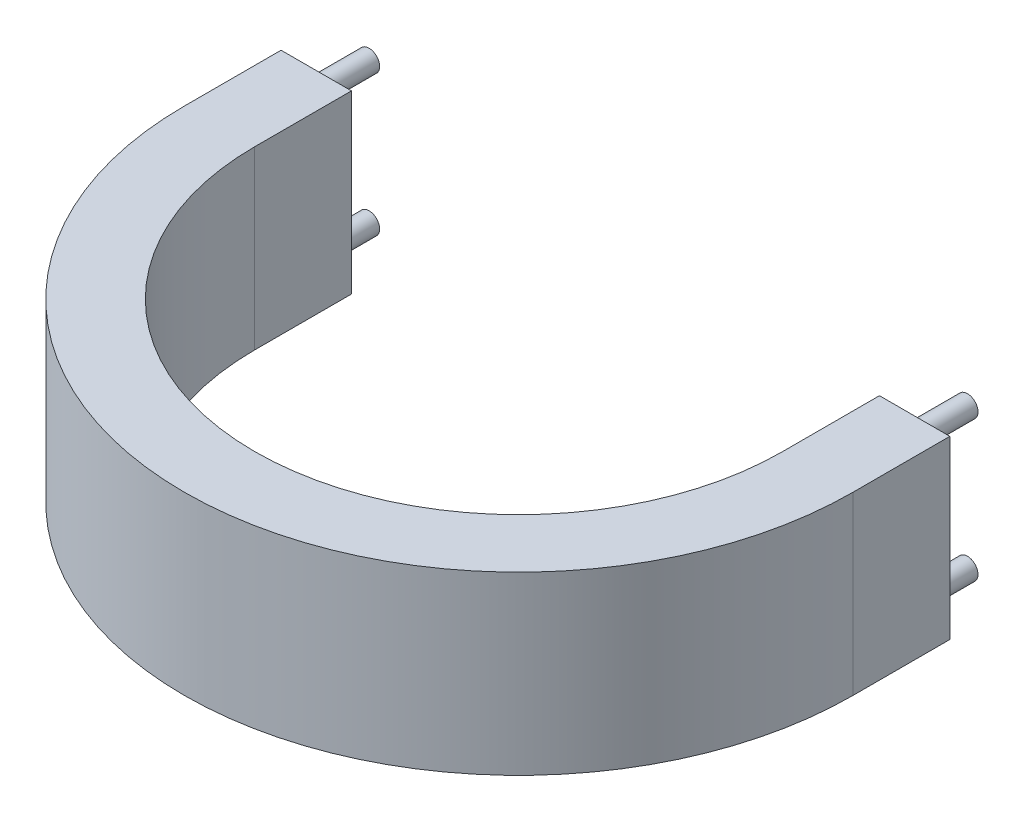
ISO-10303-21;
HEADER;
FILE_DESCRIPTION(('STEP AP214'),'2;1');
FILE_NAME('part.step','',(''),(''),'','','');
FILE_SCHEMA(('AUTOMOTIVE_DESIGN { 1 0 10303 214 1 1 1 1 }'));
ENDSEC;
DATA;
#1=APPLICATION_CONTEXT('core data for automotive mechanical design processes');
#2=APPLICATION_PROTOCOL_DEFINITION('international standard','automotive_design',2000,#1);
#3=PRODUCT_CONTEXT('',#1,'mechanical');
#4=PRODUCT('Part','Part','',(#3));
#5=PRODUCT_RELATED_PRODUCT_CATEGORY('part','',(#4));
#6=PRODUCT_DEFINITION_FORMATION('','',#4);
#7=PRODUCT_DEFINITION_CONTEXT('part definition',#1,'design');
#8=PRODUCT_DEFINITION('design','',#6,#7);
#9=PRODUCT_DEFINITION_SHAPE('','',#8);
#10=(LENGTH_UNIT() NAMED_UNIT(*) SI_UNIT(.MILLI.,.METRE.));
#11=(NAMED_UNIT(*) PLANE_ANGLE_UNIT() SI_UNIT($,.RADIAN.));
#12=(NAMED_UNIT(*) SI_UNIT($,.STERADIAN.) SOLID_ANGLE_UNIT());
#13=UNCERTAINTY_MEASURE_WITH_UNIT(LENGTH_MEASURE(1.E-05),#10,'distance_accuracy_value','');
#14=(GEOMETRIC_REPRESENTATION_CONTEXT(3) GLOBAL_UNCERTAINTY_ASSIGNED_CONTEXT((#13)) GLOBAL_UNIT_ASSIGNED_CONTEXT((#10,
#11,#12)) REPRESENTATION_CONTEXT('',''));
#15=CARTESIAN_POINT('',(0.,0.,0.));
#16=DIRECTION('',(0.,0.,1.));
#17=DIRECTION('',(1.,0.,0.));
#18=AXIS2_PLACEMENT_3D('',#15,#16,#17);
#19=CARTESIAN_POINT('',(0.,20.,0.));
#20=DIRECTION('',(0.,-1.,0.));
#21=DIRECTION('',(0.,0.,-1.));
#22=AXIS2_PLACEMENT_3D('',#19,#20,#21);
#23=CYLINDRICAL_SURFACE('',#22,38.);
#24=CARTESIAN_POINT('',(0.,0.,0.));
#25=DIRECTION('',(0.,1.,0.));
#26=DIRECTION('',(0.,0.,1.));
#27=AXIS2_PLACEMENT_3D('',#24,#25,#26);
#28=CIRCLE('',#27,38.);
#29=CARTESIAN_POINT('',(-38.,0.,0.));
#30=VERTEX_POINT('',#29);
#31=CARTESIAN_POINT('',(38.,0.,0.));
#32=VERTEX_POINT('',#31);
#33=EDGE_CURVE('E135',#30,#32,#28,.T.);
#34=ORIENTED_EDGE('',*,*,#33,.T.);
#35=DIRECTION('',(0.,-1.,0.));
#36=VECTOR('',#35,1.);
#37=CARTESIAN_POINT('',(38.,20.,0.));
#38=LINE('',#37,#36);
#39=CARTESIAN_POINT('',(38.,20.,0.));
#40=VERTEX_POINT('',#39);
#41=EDGE_CURVE('E163',#40,#32,#38,.T.);
#42=ORIENTED_EDGE('',*,*,#41,.F.);
#43=CARTESIAN_POINT('',(0.,20.,0.));
#44=DIRECTION('',(0.,1.,0.));
#45=DIRECTION('',(0.,0.,1.));
#46=AXIS2_PLACEMENT_3D('',#43,#44,#45);
#47=CIRCLE('',#46,38.);
#48=CARTESIAN_POINT('',(-38.,20.,0.));
#49=VERTEX_POINT('',#48);
#50=EDGE_CURVE('E150',#49,#40,#47,.T.);
#51=ORIENTED_EDGE('',*,*,#50,.F.);
#52=DIRECTION('',(0.,-1.,0.));
#53=VECTOR('',#52,1.);
#54=CARTESIAN_POINT('',(-38.,20.,0.));
#55=LINE('',#54,#53);
#56=EDGE_CURVE('E131',#49,#30,#55,.T.);
#57=ORIENTED_EDGE('',*,*,#56,.T.);
#58=EDGE_LOOP('',(#34,#42,#51,#57));
#59=FACE_BOUND('',#58,.T.);
#60=ADVANCED_FACE('F38',(#59),#23,.T.);
#61=CARTESIAN_POINT('',(38.,20.,0.));
#62=DIRECTION('',(-1.,0.,0.));
#63=DIRECTION('',(0.,0.,1.));
#64=AXIS2_PLACEMENT_3D('',#61,#62,#63);
#65=PLANE('',#64);
#66=DIRECTION('',(0.,0.,-1.));
#67=VECTOR('',#66,1.);
#68=CARTESIAN_POINT('',(38.,0.,0.));
#69=LINE('',#68,#67);
#70=CARTESIAN_POINT('',(38.,0.,-11.));
#71=VERTEX_POINT('',#70);
#72=EDGE_CURVE('E138',#32,#71,#69,.T.);
#73=ORIENTED_EDGE('',*,*,#72,.T.);
#74=DIRECTION('',(0.,-1.,0.));
#75=VECTOR('',#74,1.);
#76=CARTESIAN_POINT('',(38.,20.,-11.));
#77=LINE('',#76,#75);
#78=CARTESIAN_POINT('',(38.,20.,-11.));
#79=VERTEX_POINT('',#78);
#80=EDGE_CURVE('E160',#79,#71,#77,.T.);
#81=ORIENTED_EDGE('',*,*,#80,.F.);
#82=DIRECTION('',(0.,0.,-1.));
#83=VECTOR('',#82,1.);
#84=CARTESIAN_POINT('',(38.,20.,0.));
#85=LINE('',#84,#83);
#86=EDGE_CURVE('E98',#40,#79,#85,.T.);
#87=ORIENTED_EDGE('',*,*,#86,.F.);
#88=ORIENTED_EDGE('',*,*,#41,.T.);
#89=EDGE_LOOP('',(#73,#81,#87,#88));
#90=FACE_BOUND('',#89,.T.);
#91=ADVANCED_FACE('F188',(#90),#65,.F.);
#92=CARTESIAN_POINT('',(30.,20.,-11.));
#93=DIRECTION('',(0.,0.,1.));
#94=DIRECTION('',(1.,0.,0.));
#95=AXIS2_PLACEMENT_3D('',#92,#93,#94);
#96=PLANE('',#95);
#97=CARTESIAN_POINT('',(34.,2.,-11.));
#98=DIRECTION('',(0.,0.,1.));
#99=DIRECTION('',(1.,0.,0.));
#100=AXIS2_PLACEMENT_3D('',#97,#98,#99);
#101=CIRCLE('',#100,1.2);
#102=CARTESIAN_POINT('',(35.2,2.,-11.));
#103=VERTEX_POINT('',#102);
#104=EDGE_CURVE('E168',#103,#103,#101,.F.);
#105=ORIENTED_EDGE('',*,*,#104,.F.);
#106=EDGE_LOOP('',(#105));
#107=FACE_BOUND('',#106,.T.);
#108=CARTESIAN_POINT('',(34.,18.,-11.));
#109=DIRECTION('',(0.,0.,1.));
#110=DIRECTION('',(1.,0.,0.));
#111=AXIS2_PLACEMENT_3D('',#108,#109,#110);
#112=CIRCLE('',#111,1.2);
#113=CARTESIAN_POINT('',(35.2,18.,-11.));
#114=VERTEX_POINT('',#113);
#115=EDGE_CURVE('E165',#114,#114,#112,.F.);
#116=ORIENTED_EDGE('',*,*,#115,.F.);
#117=EDGE_LOOP('',(#116));
#118=FACE_BOUND('',#117,.T.);
#119=DIRECTION('',(-1.,0.,0.));
#120=VECTOR('',#119,1.);
#121=CARTESIAN_POINT('',(30.,0.,-11.));
#122=LINE('',#121,#120);
#123=CARTESIAN_POINT('',(30.,0.,-11.));
#124=VERTEX_POINT('',#123);
#125=EDGE_CURVE('E141',#71,#124,#122,.T.);
#126=ORIENTED_EDGE('',*,*,#125,.T.);
#127=DIRECTION('',(0.,-1.,0.));
#128=VECTOR('',#127,1.);
#129=CARTESIAN_POINT('',(30.,20.,-11.));
#130=LINE('',#129,#128);
#131=CARTESIAN_POINT('',(30.,20.,-11.));
#132=VERTEX_POINT('',#131);
#133=EDGE_CURVE('E157',#132,#124,#130,.T.);
#134=ORIENTED_EDGE('',*,*,#133,.F.);
#135=DIRECTION('',(-1.,0.,0.));
#136=VECTOR('',#135,1.);
#137=CARTESIAN_POINT('',(30.,20.,-11.));
#138=LINE('',#137,#136);
#139=EDGE_CURVE('E204',#79,#132,#138,.T.);
#140=ORIENTED_EDGE('',*,*,#139,.F.);
#141=ORIENTED_EDGE('',*,*,#80,.T.);
#142=EDGE_LOOP('',(#126,#134,#140,#141));
#143=FACE_BOUND('',#142,.T.);
#144=ADVANCED_FACE('F193',(#107,#118,#143),#96,.F.);
#145=CARTESIAN_POINT('',(30.,20.,0.));
#146=DIRECTION('',(1.,0.,0.));
#147=DIRECTION('',(0.,0.,-1.));
#148=AXIS2_PLACEMENT_3D('',#145,#146,#147);
#149=PLANE('',#148);
#150=DIRECTION('',(0.,0.,1.));
#151=VECTOR('',#150,1.);
#152=CARTESIAN_POINT('',(30.,0.,0.));
#153=LINE('',#152,#151);
#154=CARTESIAN_POINT('',(30.,0.,0.));
#155=VERTEX_POINT('',#154);
#156=EDGE_CURVE('E143',#124,#155,#153,.T.);
#157=ORIENTED_EDGE('',*,*,#156,.T.);
#158=DIRECTION('',(0.,-1.,0.));
#159=VECTOR('',#158,1.);
#160=CARTESIAN_POINT('',(30.,20.,0.));
#161=LINE('',#160,#159);
#162=CARTESIAN_POINT('',(30.,20.,0.));
#163=VERTEX_POINT('',#162);
#164=EDGE_CURVE('E154',#163,#155,#161,.T.);
#165=ORIENTED_EDGE('',*,*,#164,.F.);
#166=DIRECTION('',(0.,0.,1.));
#167=VECTOR('',#166,1.);
#168=CARTESIAN_POINT('',(30.,20.,0.));
#169=LINE('',#168,#167);
#170=EDGE_CURVE('E206',#132,#163,#169,.T.);
#171=ORIENTED_EDGE('',*,*,#170,.F.);
#172=ORIENTED_EDGE('',*,*,#133,.T.);
#173=EDGE_LOOP('',(#157,#165,#171,#172));
#174=FACE_BOUND('',#173,.T.);
#175=ADVANCED_FACE('F340',(#174),#149,.F.);
#176=CARTESIAN_POINT('',(0.,20.,0.));
#177=DIRECTION('',(0.,-1.,0.));
#178=DIRECTION('',(0.,0.,-1.));
#179=AXIS2_PLACEMENT_3D('',#176,#177,#178);
#180=CYLINDRICAL_SURFACE('',#179,30.);
#181=CARTESIAN_POINT('',(0.,0.,0.));
#182=DIRECTION('',(0.,-1.,0.));
#183=DIRECTION('',(0.,0.,1.));
#184=AXIS2_PLACEMENT_3D('',#181,#182,#183);
#185=CIRCLE('',#184,30.);
#186=CARTESIAN_POINT('',(-30.,0.,0.));
#187=VERTEX_POINT('',#186);
#188=EDGE_CURVE('E145',#155,#187,#185,.T.);
#189=ORIENTED_EDGE('',*,*,#188,.T.);
#190=DIRECTION('',(0.,-1.,0.));
#191=VECTOR('',#190,1.);
#192=CARTESIAN_POINT('',(-30.,20.,0.));
#193=LINE('',#192,#191);
#194=CARTESIAN_POINT('',(-30.,20.,0.));
#195=VERTEX_POINT('',#194);
#196=EDGE_CURVE('E126',#195,#187,#193,.T.);
#197=ORIENTED_EDGE('',*,*,#196,.F.);
#198=CARTESIAN_POINT('',(0.,20.,0.));
#199=DIRECTION('',(0.,-1.,0.));
#200=DIRECTION('',(0.,0.,1.));
#201=AXIS2_PLACEMENT_3D('',#198,#199,#200);
#202=CIRCLE('',#201,30.);
#203=EDGE_CURVE('E117',#163,#195,#202,.T.);
#204=ORIENTED_EDGE('',*,*,#203,.F.);
#205=ORIENTED_EDGE('',*,*,#164,.T.);
#206=EDGE_LOOP('',(#189,#197,#204,#205));
#207=FACE_BOUND('',#206,.T.);
#208=ADVANCED_FACE('F184',(#207),#180,.F.);
#209=CARTESIAN_POINT('',(-30.,20.,0.));
#210=DIRECTION('',(-1.,0.,0.));
#211=DIRECTION('',(0.,0.,1.));
#212=AXIS2_PLACEMENT_3D('',#209,#210,#211);
#213=PLANE('',#212);
#214=DIRECTION('',(0.,0.,-1.));
#215=VECTOR('',#214,1.);
#216=CARTESIAN_POINT('',(-30.,0.,0.));
#217=LINE('',#216,#215);
#218=CARTESIAN_POINT('',(-30.,0.,-11.));
#219=VERTEX_POINT('',#218);
#220=EDGE_CURVE('E125',#187,#219,#217,.T.);
#221=ORIENTED_EDGE('',*,*,#220,.T.);
#222=DIRECTION('',(0.,-1.,0.));
#223=VECTOR('',#222,1.);
#224=CARTESIAN_POINT('',(-30.,20.,-11.));
#225=LINE('',#224,#223);
#226=CARTESIAN_POINT('',(-30.,20.,-11.));
#227=VERTEX_POINT('',#226);
#228=EDGE_CURVE('E122',#227,#219,#225,.T.);
#229=ORIENTED_EDGE('',*,*,#228,.F.);
#230=DIRECTION('',(0.,0.,-1.));
#231=VECTOR('',#230,1.);
#232=CARTESIAN_POINT('',(-30.,20.,0.));
#233=LINE('',#232,#231);
#234=EDGE_CURVE('E111',#195,#227,#233,.T.);
#235=ORIENTED_EDGE('',*,*,#234,.F.);
#236=ORIENTED_EDGE('',*,*,#196,.T.);
#237=EDGE_LOOP('',(#221,#229,#235,#236));
#238=FACE_BOUND('',#237,.T.);
#239=ADVANCED_FACE('F123',(#238),#213,.F.);
#240=CARTESIAN_POINT('',(-38.,20.,-11.));
#241=DIRECTION('',(0.,0.,1.));
#242=DIRECTION('',(1.,0.,0.));
#243=AXIS2_PLACEMENT_3D('',#240,#241,#242);
#244=PLANE('',#243);
#245=CARTESIAN_POINT('',(-34.,2.,-11.));
#246=DIRECTION('',(0.,0.,1.));
#247=DIRECTION('',(1.,0.,0.));
#248=AXIS2_PLACEMENT_3D('',#245,#246,#247);
#249=CIRCLE('',#248,1.2);
#250=CARTESIAN_POINT('',(-32.8,2.,-11.));
#251=VERTEX_POINT('',#250);
#252=EDGE_CURVE('E11',#251,#251,#249,.F.);
#253=ORIENTED_EDGE('',*,*,#252,.F.);
#254=EDGE_LOOP('',(#253));
#255=FACE_BOUND('',#254,.T.);
#256=CARTESIAN_POINT('',(-34.,18.,-11.));
#257=DIRECTION('',(0.,0.,1.));
#258=DIRECTION('',(1.,0.,0.));
#259=AXIS2_PLACEMENT_3D('',#256,#257,#258);
#260=CIRCLE('',#259,1.2);
#261=CARTESIAN_POINT('',(-32.8,18.,-11.));
#262=VERTEX_POINT('',#261);
#263=EDGE_CURVE('E46',#262,#262,#260,.F.);
#264=ORIENTED_EDGE('',*,*,#263,.F.);
#265=EDGE_LOOP('',(#264));
#266=FACE_BOUND('',#265,.T.);
#267=DIRECTION('',(-1.,0.,0.));
#268=VECTOR('',#267,1.);
#269=CARTESIAN_POINT('',(-38.,0.,-11.));
#270=LINE('',#269,#268);
#271=CARTESIAN_POINT('',(-38.,0.,-11.));
#272=VERTEX_POINT('',#271);
#273=EDGE_CURVE('E83',#219,#272,#270,.T.);
#274=ORIENTED_EDGE('',*,*,#273,.T.);
#275=DIRECTION('',(0.,-1.,0.));
#276=VECTOR('',#275,1.);
#277=CARTESIAN_POINT('',(-38.,20.,-11.));
#278=LINE('',#277,#276);
#279=CARTESIAN_POINT('',(-38.,20.,-11.));
#280=VERTEX_POINT('',#279);
#281=EDGE_CURVE('E127',#280,#272,#278,.T.);
#282=ORIENTED_EDGE('',*,*,#281,.F.);
#283=DIRECTION('',(-1.,0.,0.));
#284=VECTOR('',#283,1.);
#285=CARTESIAN_POINT('',(-38.,20.,-11.));
#286=LINE('',#285,#284);
#287=EDGE_CURVE('E115',#227,#280,#286,.T.);
#288=ORIENTED_EDGE('',*,*,#287,.F.);
#289=ORIENTED_EDGE('',*,*,#228,.T.);
#290=EDGE_LOOP('',(#274,#282,#288,#289));
#291=FACE_BOUND('',#290,.T.);
#292=ADVANCED_FACE('F129',(#255,#266,#291),#244,.F.);
#293=CARTESIAN_POINT('',(-38.,20.,0.));
#294=DIRECTION('',(1.,0.,0.));
#295=DIRECTION('',(0.,0.,-1.));
#296=AXIS2_PLACEMENT_3D('',#293,#294,#295);
#297=PLANE('',#296);
#298=DIRECTION('',(0.,0.,1.));
#299=VECTOR('',#298,1.);
#300=CARTESIAN_POINT('',(-38.,0.,0.));
#301=LINE('',#300,#299);
#302=EDGE_CURVE('E89',#272,#30,#301,.T.);
#303=ORIENTED_EDGE('',*,*,#302,.T.);
#304=ORIENTED_EDGE('',*,*,#56,.F.);
#305=DIRECTION('',(0.,0.,1.));
#306=VECTOR('',#305,1.);
#307=CARTESIAN_POINT('',(-38.,20.,0.));
#308=LINE('',#307,#306);
#309=EDGE_CURVE('E54',#280,#49,#308,.T.);
#310=ORIENTED_EDGE('',*,*,#309,.F.);
#311=ORIENTED_EDGE('',*,*,#281,.T.);
#312=EDGE_LOOP('',(#303,#304,#310,#311));
#313=FACE_BOUND('',#312,.T.);
#314=ADVANCED_FACE('F176',(#313),#297,.F.);
#315=CARTESIAN_POINT('',(0.,20.,0.));
#316=DIRECTION('',(0.,1.,0.));
#317=DIRECTION('',(0.,0.,1.));
#318=AXIS2_PLACEMENT_3D('',#315,#316,#317);
#319=PLANE('',#318);
#320=ORIENTED_EDGE('',*,*,#50,.T.);
#321=ORIENTED_EDGE('',*,*,#86,.T.);
#322=ORIENTED_EDGE('',*,*,#139,.T.);
#323=ORIENTED_EDGE('',*,*,#170,.T.);
#324=ORIENTED_EDGE('',*,*,#203,.T.);
#325=ORIENTED_EDGE('',*,*,#234,.T.);
#326=ORIENTED_EDGE('',*,*,#287,.T.);
#327=ORIENTED_EDGE('',*,*,#309,.T.);
#328=EDGE_LOOP('',(#320,#321,#322,#323,#324,#325,#326,#327));
#329=FACE_BOUND('',#328,.T.);
#330=ADVANCED_FACE('F113',(#329),#319,.T.);
#331=CARTESIAN_POINT('',(0.,0.,0.));
#332=DIRECTION('',(0.,1.,0.));
#333=DIRECTION('',(0.,0.,1.));
#334=AXIS2_PLACEMENT_3D('',#331,#332,#333);
#335=PLANE('',#334);
#336=ORIENTED_EDGE('',*,*,#33,.F.);
#337=ORIENTED_EDGE('',*,*,#302,.F.);
#338=ORIENTED_EDGE('',*,*,#273,.F.);
#339=ORIENTED_EDGE('',*,*,#220,.F.);
#340=ORIENTED_EDGE('',*,*,#188,.F.);
#341=ORIENTED_EDGE('',*,*,#156,.F.);
#342=ORIENTED_EDGE('',*,*,#125,.F.);
#343=ORIENTED_EDGE('',*,*,#72,.F.);
#344=EDGE_LOOP('',(#336,#337,#338,#339,#340,#341,#342,#343));
#345=FACE_BOUND('',#344,.T.);
#346=ADVANCED_FACE('F198',(#345),#335,.F.);
#347=CARTESIAN_POINT('',(34.,18.,-17.));
#348=DIRECTION('',(0.,0.,1.));
#349=DIRECTION('',(1.,0.,0.));
#350=AXIS2_PLACEMENT_3D('',#347,#348,#349);
#351=CYLINDRICAL_SURFACE('',#350,1.2);
#352=CARTESIAN_POINT('',(34.,18.,-17.));
#353=DIRECTION('',(0.,0.,-1.));
#354=DIRECTION('',(-1.,0.,0.));
#355=AXIS2_PLACEMENT_3D('',#352,#353,#354);
#356=CIRCLE('',#355,1.2);
#357=CARTESIAN_POINT('',(32.8,18.,-17.));
#358=VERTEX_POINT('',#357);
#359=EDGE_CURVE('E139',#358,#358,#356,.T.);
#360=ORIENTED_EDGE('',*,*,#359,.F.);
#361=EDGE_LOOP('',(#360));
#362=FACE_BOUND('',#361,.T.);
#363=ORIENTED_EDGE('',*,*,#115,.T.);
#364=EDGE_LOOP('',(#363));
#365=FACE_BOUND('',#364,.T.);
#366=ADVANCED_FACE('F253',(#362,#365),#351,.T.);
#367=CARTESIAN_POINT('',(34.,18.,-17.));
#368=DIRECTION('',(0.,0.,-1.));
#369=DIRECTION('',(-1.,0.,0.));
#370=AXIS2_PLACEMENT_3D('',#367,#368,#369);
#371=PLANE('',#370);
#372=ORIENTED_EDGE('',*,*,#359,.T.);
#373=EDGE_LOOP('',(#372));
#374=FACE_BOUND('',#373,.T.);
#375=ADVANCED_FACE('F249',(#374),#371,.T.);
#376=CARTESIAN_POINT('',(34.,2.,-17.));
#377=DIRECTION('',(0.,0.,1.));
#378=DIRECTION('',(1.,0.,0.));
#379=AXIS2_PLACEMENT_3D('',#376,#377,#378);
#380=CYLINDRICAL_SURFACE('',#379,1.2);
#381=CARTESIAN_POINT('',(34.,2.,-17.));
#382=DIRECTION('',(0.,0.,-1.));
#383=DIRECTION('',(-1.,0.,0.));
#384=AXIS2_PLACEMENT_3D('',#381,#382,#383);
#385=CIRCLE('',#384,1.2);
#386=CARTESIAN_POINT('',(32.8,2.,-17.));
#387=VERTEX_POINT('',#386);
#388=EDGE_CURVE('E214',#387,#387,#385,.T.);
#389=ORIENTED_EDGE('',*,*,#388,.F.);
#390=EDGE_LOOP('',(#389));
#391=FACE_BOUND('',#390,.T.);
#392=ORIENTED_EDGE('',*,*,#104,.T.);
#393=EDGE_LOOP('',(#392));
#394=FACE_BOUND('',#393,.T.);
#395=ADVANCED_FACE('F245',(#391,#394),#380,.T.);
#396=CARTESIAN_POINT('',(34.,2.,-17.));
#397=DIRECTION('',(0.,0.,-1.));
#398=DIRECTION('',(-1.,0.,0.));
#399=AXIS2_PLACEMENT_3D('',#396,#397,#398);
#400=PLANE('',#399);
#401=ORIENTED_EDGE('',*,*,#388,.T.);
#402=EDGE_LOOP('',(#401));
#403=FACE_BOUND('',#402,.T.);
#404=ADVANCED_FACE('F241',(#403),#400,.T.);
#405=CARTESIAN_POINT('',(-34.,18.,-17.));
#406=DIRECTION('',(0.,0.,1.));
#407=DIRECTION('',(1.,0.,0.));
#408=AXIS2_PLACEMENT_3D('',#405,#406,#407);
#409=CYLINDRICAL_SURFACE('',#408,1.2);
#410=CARTESIAN_POINT('',(-34.,18.,-17.));
#411=DIRECTION('',(0.,0.,-1.));
#412=DIRECTION('',(-1.,0.,0.));
#413=AXIS2_PLACEMENT_3D('',#410,#411,#412);
#414=CIRCLE('',#413,1.2);
#415=CARTESIAN_POINT('',(-35.2,18.,-17.));
#416=VERTEX_POINT('',#415);
#417=EDGE_CURVE('E217',#416,#416,#414,.T.);
#418=ORIENTED_EDGE('',*,*,#417,.F.);
#419=EDGE_LOOP('',(#418));
#420=FACE_BOUND('',#419,.T.);
#421=ORIENTED_EDGE('',*,*,#263,.T.);
#422=EDGE_LOOP('',(#421));
#423=FACE_BOUND('',#422,.T.);
#424=ADVANCED_FACE('F173',(#420,#423),#409,.T.);
#425=CARTESIAN_POINT('',(-34.,18.,-17.));
#426=DIRECTION('',(0.,0.,-1.));
#427=DIRECTION('',(-1.,0.,0.));
#428=AXIS2_PLACEMENT_3D('',#425,#426,#427);
#429=PLANE('',#428);
#430=ORIENTED_EDGE('',*,*,#417,.T.);
#431=EDGE_LOOP('',(#430));
#432=FACE_BOUND('',#431,.T.);
#433=ADVANCED_FACE('F229',(#432),#429,.T.);
#434=CARTESIAN_POINT('',(-34.,2.,-17.));
#435=DIRECTION('',(0.,0.,1.));
#436=DIRECTION('',(1.,0.,0.));
#437=AXIS2_PLACEMENT_3D('',#434,#435,#436);
#438=CYLINDRICAL_SURFACE('',#437,1.2);
#439=CARTESIAN_POINT('',(-34.,2.,-17.));
#440=DIRECTION('',(0.,0.,-1.));
#441=DIRECTION('',(-1.,0.,0.));
#442=AXIS2_PLACEMENT_3D('',#439,#440,#441);
#443=CIRCLE('',#442,1.2);
#444=CARTESIAN_POINT('',(-35.2,2.,-17.));
#445=VERTEX_POINT('',#444);
#446=EDGE_CURVE('E220',#445,#445,#443,.T.);
#447=ORIENTED_EDGE('',*,*,#446,.F.);
#448=EDGE_LOOP('',(#447));
#449=FACE_BOUND('',#448,.T.);
#450=ORIENTED_EDGE('',*,*,#252,.T.);
#451=EDGE_LOOP('',(#450));
#452=FACE_BOUND('',#451,.T.);
#453=ADVANCED_FACE('F226',(#449,#452),#438,.T.);
#454=CARTESIAN_POINT('',(-34.,2.,-17.));
#455=DIRECTION('',(0.,0.,-1.));
#456=DIRECTION('',(-1.,0.,0.));
#457=AXIS2_PLACEMENT_3D('',#454,#455,#456);
#458=PLANE('',#457);
#459=ORIENTED_EDGE('',*,*,#446,.T.);
#460=EDGE_LOOP('',(#459));
#461=FACE_BOUND('',#460,.T.);
#462=ADVANCED_FACE('F224',(#461),#458,.T.);
#463=CLOSED_SHELL('',(#60,#91,#144,#175,#208,#239,#292,#314,#330,#346,#366,#375,#395,#404,#424,
#433,#453,#462));
#464=MANIFOLD_SOLID_BREP('B2',#463);
#465=ADVANCED_BREP_SHAPE_REPRESENTATION('',(#18,#464),#14);
#466=SHAPE_DEFINITION_REPRESENTATION(#9,#465);
ENDSEC;
END-ISO-10303-21;
